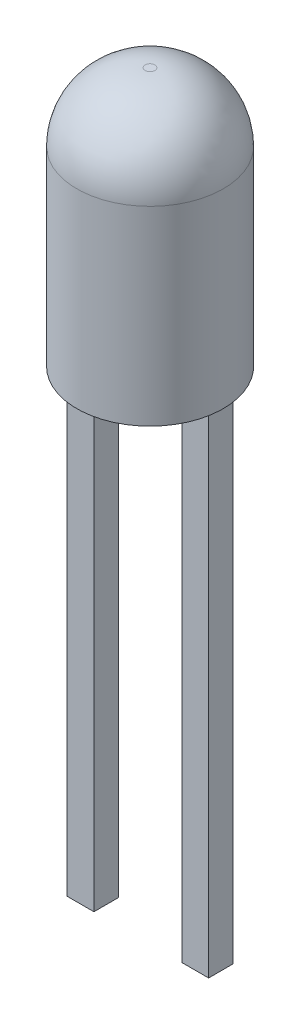
ISO-10303-21;
HEADER;
FILE_DESCRIPTION(('STEP AP214'),'2;1');
FILE_NAME('part.step','',(''),(''),'','','');
FILE_SCHEMA(('AUTOMOTIVE_DESIGN { 1 0 10303 214 1 1 1 1 }'));
ENDSEC;
DATA;
#1=APPLICATION_CONTEXT('core data for automotive mechanical design processes');
#2=APPLICATION_PROTOCOL_DEFINITION('international standard','automotive_design',2000,#1);
#3=PRODUCT_CONTEXT('',#1,'mechanical');
#4=PRODUCT('Part','Part','',(#3));
#5=PRODUCT_RELATED_PRODUCT_CATEGORY('part','',(#4));
#6=PRODUCT_DEFINITION_FORMATION('','',#4);
#7=PRODUCT_DEFINITION_CONTEXT('part definition',#1,'design');
#8=PRODUCT_DEFINITION('design','',#6,#7);
#9=PRODUCT_DEFINITION_SHAPE('','',#8);
#10=(LENGTH_UNIT() NAMED_UNIT(*) SI_UNIT(.MILLI.,.METRE.));
#11=(NAMED_UNIT(*) PLANE_ANGLE_UNIT() SI_UNIT($,.RADIAN.));
#12=(NAMED_UNIT(*) SI_UNIT($,.STERADIAN.) SOLID_ANGLE_UNIT());
#13=UNCERTAINTY_MEASURE_WITH_UNIT(LENGTH_MEASURE(1.E-05),#10,'distance_accuracy_value','');
#14=(GEOMETRIC_REPRESENTATION_CONTEXT(3) GLOBAL_UNCERTAINTY_ASSIGNED_CONTEXT((#13)) GLOBAL_UNIT_ASSIGNED_CONTEXT((#10,
#11,#12)) REPRESENTATION_CONTEXT('',''));
#15=CARTESIAN_POINT('',(0.,0.,0.));
#16=DIRECTION('',(0.,0.,1.));
#17=DIRECTION('',(1.,0.,0.));
#18=AXIS2_PLACEMENT_3D('',#15,#16,#17);
#19=CARTESIAN_POINT('',(0.,0.,-0.25));
#20=DIRECTION('',(0.,0.,1.));
#21=DIRECTION('',(1.,0.,0.));
#22=AXIS2_PLACEMENT_3D('',#19,#20,#21);
#23=PLANE('',#22);
#24=DIRECTION('',(1.,0.,0.));
#25=VECTOR('',#24,1.);
#26=CARTESIAN_POINT('',(0.,0.,-0.25));
#27=LINE('',#26,#25);
#28=CARTESIAN_POINT('',(0.899999999999999,0.,-0.25));
#29=VERTEX_POINT('',#28);
#30=CARTESIAN_POINT('',(1.45,0.,-0.25));
#31=VERTEX_POINT('',#30);
#32=EDGE_CURVE('P0_E83',#29,#31,#27,.T.);
#33=ORIENTED_EDGE('',*,*,#32,.F.);
#34=DIRECTION('',(0.,1.,0.));
#35=VECTOR('',#34,1.);
#36=CARTESIAN_POINT('',(0.899999999999999,0.,-0.25));
#37=LINE('',#36,#35);
#38=CARTESIAN_POINT('',(0.899999999999999,0.6,-0.25));
#39=VERTEX_POINT('',#38);
#40=EDGE_CURVE('P0_E65',#39,#29,#37,.F.);
#41=ORIENTED_EDGE('',*,*,#40,.F.);
#42=DIRECTION('',(1.,0.,0.));
#43=VECTOR('',#42,1.);
#44=CARTESIAN_POINT('',(0.,0.6,-0.25));
#45=LINE('',#44,#43);
#46=CARTESIAN_POINT('',(0.496677265615149,0.6,-0.25));
#47=VERTEX_POINT('',#46);
#48=EDGE_CURVE('P0_E19',#47,#39,#45,.T.);
#49=ORIENTED_EDGE('',*,*,#48,.F.);
#50=DIRECTION('',(0.56488315762426,-0.825170902439274,0.));
#51=VECTOR('',#50,1.);
#52=CARTESIAN_POINT('',(-0.872452828416084,2.6,-0.25));
#53=LINE('',#52,#51);
#54=CARTESIAN_POINT('',(-0.872452828416084,2.6,-0.25));
#55=VERTEX_POINT('',#54);
#56=EDGE_CURVE('P0_E96',#55,#47,#53,.T.);
#57=ORIENTED_EDGE('',*,*,#56,.F.);
#58=DIRECTION('',(-1.,0.,0.));
#59=VECTOR('',#58,1.);
#60=CARTESIAN_POINT('',(1.45,2.6,-0.25));
#61=LINE('',#60,#59);
#62=CARTESIAN_POINT('',(1.45,2.6,-0.25));
#63=VERTEX_POINT('',#62);
#64=EDGE_CURVE('P0_E91',#63,#55,#61,.T.);
#65=ORIENTED_EDGE('',*,*,#64,.F.);
#66=DIRECTION('',(0.,1.,0.));
#67=VECTOR('',#66,1.);
#68=CARTESIAN_POINT('',(1.45,0.,-0.25));
#69=LINE('',#68,#67);
#70=EDGE_CURVE('P0_E84',#31,#63,#69,.T.);
#71=ORIENTED_EDGE('',*,*,#70,.F.);
#72=EDGE_LOOP('',(#33,#41,#49,#57,#65,#71));
#73=FACE_BOUND('',#72,.T.);
#74=ADVANCED_FACE('P0_F16',(#73),#23,.F.);
#75=CARTESIAN_POINT('',(1.45,0.,-0.25));
#76=DIRECTION('',(1.,0.,0.));
#77=DIRECTION('',(0.,1.,0.));
#78=AXIS2_PLACEMENT_3D('',#75,#76,#77);
#79=PLANE('',#78);
#80=DIRECTION('',(0.,0.,1.));
#81=VECTOR('',#80,1.);
#82=CARTESIAN_POINT('',(1.45,0.,-0.25));
#83=LINE('',#82,#81);
#84=CARTESIAN_POINT('',(1.45,0.,0.25));
#85=VERTEX_POINT('',#84);
#86=EDGE_CURVE('P0_E79',#31,#85,#83,.T.);
#87=ORIENTED_EDGE('',*,*,#86,.F.);
#88=ORIENTED_EDGE('',*,*,#70,.T.);
#89=DIRECTION('',(0.,0.,1.));
#90=VECTOR('',#89,1.);
#91=CARTESIAN_POINT('',(1.45,2.6,-0.25));
#92=LINE('',#91,#90);
#93=CARTESIAN_POINT('',(1.45,2.6,0.25));
#94=VERTEX_POINT('',#93);
#95=EDGE_CURVE('P0_E88',#94,#63,#92,.F.);
#96=ORIENTED_EDGE('',*,*,#95,.F.);
#97=DIRECTION('',(0.,1.,0.));
#98=VECTOR('',#97,1.);
#99=CARTESIAN_POINT('',(1.45,0.,0.25));
#100=LINE('',#99,#98);
#101=EDGE_CURVE('P0_E102',#85,#94,#100,.T.);
#102=ORIENTED_EDGE('',*,*,#101,.F.);
#103=EDGE_LOOP('',(#87,#88,#96,#102));
#104=FACE_BOUND('',#103,.T.);
#105=ADVANCED_FACE('P0_F124',(#104),#79,.T.);
#106=CARTESIAN_POINT('',(1.45,2.6,-0.25));
#107=DIRECTION('',(0.,1.,0.));
#108=DIRECTION('',(-1.,0.,0.));
#109=AXIS2_PLACEMENT_3D('',#106,#107,#108);
#110=PLANE('',#109);
#111=ORIENTED_EDGE('',*,*,#95,.T.);
#112=ORIENTED_EDGE('',*,*,#64,.T.);
#113=DIRECTION('',(0.,0.,1.));
#114=VECTOR('',#113,1.);
#115=CARTESIAN_POINT('',(-0.872452828416084,2.6,-0.25));
#116=LINE('',#115,#114);
#117=CARTESIAN_POINT('',(-0.872452828416084,2.6,0.25));
#118=VERTEX_POINT('',#117);
#119=EDGE_CURVE('P0_E93',#118,#55,#116,.F.);
#120=ORIENTED_EDGE('',*,*,#119,.F.);
#121=DIRECTION('',(1.,0.,0.));
#122=VECTOR('',#121,1.);
#123=CARTESIAN_POINT('',(0.,2.6,0.25));
#124=LINE('',#123,#122);
#125=EDGE_CURVE('P0_E105',#94,#118,#124,.F.);
#126=ORIENTED_EDGE('',*,*,#125,.F.);
#127=EDGE_LOOP('',(#111,#112,#120,#126));
#128=FACE_BOUND('',#127,.T.);
#129=ADVANCED_FACE('P0_F122',(#128),#110,.T.);
#130=CARTESIAN_POINT('',(-0.872452828416084,2.6,-0.25));
#131=DIRECTION('',(-0.825170902439274,-0.56488315762426,0.));
#132=DIRECTION('',(0.56488315762426,-0.825170902439274,0.));
#133=AXIS2_PLACEMENT_3D('',#130,#131,#132);
#134=PLANE('',#133);
#135=ORIENTED_EDGE('',*,*,#119,.T.);
#136=ORIENTED_EDGE('',*,*,#56,.T.);
#137=DIRECTION('',(0.,0.,-1.));
#138=VECTOR('',#137,1.);
#139=CARTESIAN_POINT('',(0.496677265615149,0.6,-0.25));
#140=LINE('',#139,#138);
#141=CARTESIAN_POINT('',(0.496677265615149,0.6,0.25));
#142=VERTEX_POINT('',#141);
#143=EDGE_CURVE('P0_E72',#142,#47,#140,.T.);
#144=ORIENTED_EDGE('',*,*,#143,.F.);
#145=DIRECTION('',(0.56488315762426,-0.825170902439274,0.));
#146=VECTOR('',#145,1.);
#147=CARTESIAN_POINT('',(-0.872452828416084,2.6,0.25));
#148=LINE('',#147,#146);
#149=EDGE_CURVE('P0_E108',#118,#142,#148,.T.);
#150=ORIENTED_EDGE('',*,*,#149,.F.);
#151=EDGE_LOOP('',(#135,#136,#144,#150));
#152=FACE_BOUND('',#151,.T.);
#153=ADVANCED_FACE('P0_F118',(#152),#134,.T.);
#154=CARTESIAN_POINT('',(0.496677265615149,0.6,-0.25));
#155=DIRECTION('',(0.,-1.,0.));
#156=DIRECTION('',(0.,0.,-1.));
#157=AXIS2_PLACEMENT_3D('',#154,#155,#156);
#158=PLANE('',#157);
#159=ORIENTED_EDGE('',*,*,#143,.T.);
#160=ORIENTED_EDGE('',*,*,#48,.T.);
#161=DIRECTION('',(0.,0.,1.));
#162=VECTOR('',#161,1.);
#163=CARTESIAN_POINT('',(0.899999999999999,0.6,-0.25));
#164=LINE('',#163,#162);
#165=CARTESIAN_POINT('',(0.899999999999999,0.6,0.25));
#166=VERTEX_POINT('',#165);
#167=EDGE_CURVE('P0_E71',#166,#39,#164,.F.);
#168=ORIENTED_EDGE('',*,*,#167,.F.);
#169=DIRECTION('',(1.,0.,0.));
#170=VECTOR('',#169,1.);
#171=CARTESIAN_POINT('',(0.,0.6,0.25));
#172=LINE('',#171,#170);
#173=EDGE_CURVE('P0_E111',#142,#166,#172,.T.);
#174=ORIENTED_EDGE('',*,*,#173,.F.);
#175=EDGE_LOOP('',(#159,#160,#168,#174));
#176=FACE_BOUND('',#175,.T.);
#177=ADVANCED_FACE('P0_F69',(#176),#158,.T.);
#178=CARTESIAN_POINT('',(0.899999999999999,0.6,-0.25));
#179=DIRECTION('',(-1.,0.,0.));
#180=DIRECTION('',(0.,0.,1.));
#181=AXIS2_PLACEMENT_3D('',#178,#179,#180);
#182=PLANE('',#181);
#183=ORIENTED_EDGE('',*,*,#167,.T.);
#184=ORIENTED_EDGE('',*,*,#40,.T.);
#185=DIRECTION('',(0.,0.,1.));
#186=VECTOR('',#185,1.);
#187=CARTESIAN_POINT('',(0.899999999999999,0.,-0.25));
#188=LINE('',#187,#186);
#189=CARTESIAN_POINT('',(0.899999999999999,0.,0.25));
#190=VERTEX_POINT('',#189);
#191=EDGE_CURVE('P0_E34',#190,#29,#188,.F.);
#192=ORIENTED_EDGE('',*,*,#191,.F.);
#193=DIRECTION('',(0.,1.,0.));
#194=VECTOR('',#193,1.);
#195=CARTESIAN_POINT('',(0.899999999999999,0.,0.25));
#196=LINE('',#195,#194);
#197=EDGE_CURVE('P0_E25',#166,#190,#196,.F.);
#198=ORIENTED_EDGE('',*,*,#197,.F.);
#199=EDGE_LOOP('',(#183,#184,#192,#198));
#200=FACE_BOUND('',#199,.T.);
#201=ADVANCED_FACE('P0_F76',(#200),#182,.T.);
#202=CARTESIAN_POINT('',(0.899999999999999,0.,-0.25));
#203=DIRECTION('',(0.,-1.,0.));
#204=DIRECTION('',(1.,0.,0.));
#205=AXIS2_PLACEMENT_3D('',#202,#203,#204);
#206=PLANE('',#205);
#207=ORIENTED_EDGE('',*,*,#191,.T.);
#208=ORIENTED_EDGE('',*,*,#32,.T.);
#209=ORIENTED_EDGE('',*,*,#86,.T.);
#210=DIRECTION('',(1.,0.,0.));
#211=VECTOR('',#210,1.);
#212=CARTESIAN_POINT('',(0.,0.,0.25));
#213=LINE('',#212,#211);
#214=EDGE_CURVE('P0_E11',#190,#85,#213,.T.);
#215=ORIENTED_EDGE('',*,*,#214,.F.);
#216=EDGE_LOOP('',(#207,#208,#209,#215));
#217=FACE_BOUND('',#216,.T.);
#218=ADVANCED_FACE('P0_F126',(#217),#206,.T.);
#219=CARTESIAN_POINT('',(0.,0.,0.25));
#220=DIRECTION('',(0.,0.,1.));
#221=DIRECTION('',(1.,0.,0.));
#222=AXIS2_PLACEMENT_3D('',#219,#220,#221);
#223=PLANE('',#222);
#224=ORIENTED_EDGE('',*,*,#197,.T.);
#225=ORIENTED_EDGE('',*,*,#214,.T.);
#226=ORIENTED_EDGE('',*,*,#101,.T.);
#227=ORIENTED_EDGE('',*,*,#125,.T.);
#228=ORIENTED_EDGE('',*,*,#149,.T.);
#229=ORIENTED_EDGE('',*,*,#173,.T.);
#230=EDGE_LOOP('',(#224,#225,#226,#227,#228,#229));
#231=FACE_BOUND('',#230,.T.);
#232=ADVANCED_FACE('P0_F114',(#231),#223,.T.);
#233=CLOSED_SHELL('',(#74,#105,#129,#153,#177,#201,#218,#232));
#234=MANIFOLD_SOLID_BREP('P0_B1',#233);
#235=CARTESIAN_POINT('',(0.899999999999999,-10.,0.25));
#236=DIRECTION('',(0.,0.,-1.));
#237=DIRECTION('',(-1.,0.,0.));
#238=AXIS2_PLACEMENT_3D('',#235,#236,#237);
#239=PLANE('',#238);
#240=DIRECTION('',(0.,1.,0.));
#241=VECTOR('',#240,1.);
#242=CARTESIAN_POINT('',(0.899999999999999,-10.,0.25));
#243=LINE('',#242,#241);
#244=CARTESIAN_POINT('',(0.899999999999999,0.,0.25));
#245=VERTEX_POINT('',#244);
#246=CARTESIAN_POINT('',(0.899999999999999,-10.,0.25));
#247=VERTEX_POINT('',#246);
#248=EDGE_CURVE('P1_E57',#245,#247,#243,.F.);
#249=ORIENTED_EDGE('',*,*,#248,.T.);
#250=DIRECTION('',(1.,0.,0.));
#251=VECTOR('',#250,1.);
#252=CARTESIAN_POINT('',(0.,-10.,0.25));
#253=LINE('',#252,#251);
#254=CARTESIAN_POINT('',(1.45,-10.,0.25));
#255=VERTEX_POINT('',#254);
#256=EDGE_CURVE('P1_E54',#255,#247,#253,.F.);
#257=ORIENTED_EDGE('',*,*,#256,.F.);
#258=DIRECTION('',(0.,1.,0.));
#259=VECTOR('',#258,1.);
#260=CARTESIAN_POINT('',(1.45,-10.,0.25));
#261=LINE('',#260,#259);
#262=CARTESIAN_POINT('',(1.45,0.,0.25));
#263=VERTEX_POINT('',#262);
#264=EDGE_CURVE('P1_E76',#255,#263,#261,.T.);
#265=ORIENTED_EDGE('',*,*,#264,.T.);
#266=DIRECTION('',(-1.,0.,0.));
#267=VECTOR('',#266,1.);
#268=CARTESIAN_POINT('',(0.899999999999999,0.,0.25));
#269=LINE('',#268,#267);
#270=EDGE_CURVE('P1_E19',#245,#263,#269,.F.);
#271=ORIENTED_EDGE('',*,*,#270,.F.);
#272=EDGE_LOOP('',(#249,#257,#265,#271));
#273=FACE_BOUND('',#272,.T.);
#274=ADVANCED_FACE('P1_F16',(#273),#239,.F.);
#275=CARTESIAN_POINT('',(0.899999999999999,-10.,0.25));
#276=DIRECTION('',(1.,0.,0.));
#277=DIRECTION('',(0.,0.,-1.));
#278=AXIS2_PLACEMENT_3D('',#275,#276,#277);
#279=PLANE('',#278);
#280=DIRECTION('',(0.,1.,0.));
#281=VECTOR('',#280,1.);
#282=CARTESIAN_POINT('',(0.899999999999999,-10.,-0.25));
#283=LINE('',#282,#281);
#284=CARTESIAN_POINT('',(0.899999999999999,0.,-0.25));
#285=VERTEX_POINT('',#284);
#286=CARTESIAN_POINT('',(0.899999999999999,-10.,-0.25));
#287=VERTEX_POINT('',#286);
#288=EDGE_CURVE('P1_E72',#285,#287,#283,.F.);
#289=ORIENTED_EDGE('',*,*,#288,.T.);
#290=DIRECTION('',(0.,0.,-1.));
#291=VECTOR('',#290,1.);
#292=CARTESIAN_POINT('',(0.899999999999999,-10.,0.));
#293=LINE('',#292,#291);
#294=EDGE_CURVE('P1_E62',#247,#287,#293,.T.);
#295=ORIENTED_EDGE('',*,*,#294,.F.);
#296=ORIENTED_EDGE('',*,*,#248,.F.);
#297=DIRECTION('',(0.,0.,-1.));
#298=VECTOR('',#297,1.);
#299=CARTESIAN_POINT('',(0.899999999999999,0.,0.));
#300=LINE('',#299,#298);
#301=EDGE_CURVE('P1_E79',#245,#285,#300,.T.);
#302=ORIENTED_EDGE('',*,*,#301,.T.);
#303=EDGE_LOOP('',(#289,#295,#296,#302));
#304=FACE_BOUND('',#303,.T.);
#305=ADVANCED_FACE('P1_F71',(#304),#279,.F.);
#306=CARTESIAN_POINT('',(0.,-10.,0.));
#307=DIRECTION('',(0.,-1.,0.));
#308=DIRECTION('',(0.,0.,-1.));
#309=AXIS2_PLACEMENT_3D('',#306,#307,#308);
#310=PLANE('',#309);
#311=DIRECTION('',(0.,0.,1.));
#312=VECTOR('',#311,1.);
#313=CARTESIAN_POINT('',(1.45,-10.,0.25));
#314=LINE('',#313,#312);
#315=CARTESIAN_POINT('',(1.45,-10.,-0.25));
#316=VERTEX_POINT('',#315);
#317=EDGE_CURVE('P1_E68',#316,#255,#314,.T.);
#318=ORIENTED_EDGE('',*,*,#317,.T.);
#319=ORIENTED_EDGE('',*,*,#256,.T.);
#320=ORIENTED_EDGE('',*,*,#294,.T.);
#321=DIRECTION('',(1.,0.,0.));
#322=VECTOR('',#321,1.);
#323=CARTESIAN_POINT('',(0.899999999999999,-10.,-0.25));
#324=LINE('',#323,#322);
#325=EDGE_CURVE('P1_E82',#287,#316,#324,.T.);
#326=ORIENTED_EDGE('',*,*,#325,.T.);
#327=EDGE_LOOP('',(#318,#319,#320,#326));
#328=FACE_BOUND('',#327,.T.);
#329=ADVANCED_FACE('P1_F65',(#328),#310,.T.);
#330=CARTESIAN_POINT('',(1.45,-10.,0.25));
#331=DIRECTION('',(-1.,0.,0.));
#332=DIRECTION('',(0.,0.,1.));
#333=AXIS2_PLACEMENT_3D('',#330,#331,#332);
#334=PLANE('',#333);
#335=ORIENTED_EDGE('',*,*,#264,.F.);
#336=ORIENTED_EDGE('',*,*,#317,.F.);
#337=DIRECTION('',(0.,1.,0.));
#338=VECTOR('',#337,1.);
#339=CARTESIAN_POINT('',(1.45,-10.,-0.25));
#340=LINE('',#339,#338);
#341=CARTESIAN_POINT('',(1.45,0.,-0.25));
#342=VERTEX_POINT('',#341);
#343=EDGE_CURVE('P1_E25',#316,#342,#340,.T.);
#344=ORIENTED_EDGE('',*,*,#343,.T.);
#345=DIRECTION('',(0.,0.,-1.));
#346=VECTOR('',#345,1.);
#347=CARTESIAN_POINT('',(1.45,0.,0.));
#348=LINE('',#347,#346);
#349=EDGE_CURVE('P1_E33',#342,#263,#348,.F.);
#350=ORIENTED_EDGE('',*,*,#349,.T.);
#351=EDGE_LOOP('',(#335,#336,#344,#350));
#352=FACE_BOUND('',#351,.T.);
#353=ADVANCED_FACE('P1_F87',(#352),#334,.F.);
#354=CARTESIAN_POINT('',(0.,0.,0.));
#355=DIRECTION('',(0.,-1.,0.));
#356=DIRECTION('',(0.,0.,-1.));
#357=AXIS2_PLACEMENT_3D('',#354,#355,#356);
#358=PLANE('',#357);
#359=ORIENTED_EDGE('',*,*,#270,.T.);
#360=ORIENTED_EDGE('',*,*,#349,.F.);
#361=DIRECTION('',(1.,0.,0.));
#362=VECTOR('',#361,1.);
#363=CARTESIAN_POINT('',(0.899999999999999,0.,-0.25));
#364=LINE('',#363,#362);
#365=EDGE_CURVE('P1_E11',#342,#285,#364,.F.);
#366=ORIENTED_EDGE('',*,*,#365,.T.);
#367=ORIENTED_EDGE('',*,*,#301,.F.);
#368=EDGE_LOOP('',(#359,#360,#366,#367));
#369=FACE_BOUND('',#368,.T.);
#370=ADVANCED_FACE('P1_F90',(#369),#358,.F.);
#371=CARTESIAN_POINT('',(0.899999999999999,-10.,-0.25));
#372=DIRECTION('',(0.,0.,1.));
#373=DIRECTION('',(1.,0.,0.));
#374=AXIS2_PLACEMENT_3D('',#371,#372,#373);
#375=PLANE('',#374);
#376=ORIENTED_EDGE('',*,*,#343,.F.);
#377=ORIENTED_EDGE('',*,*,#325,.F.);
#378=ORIENTED_EDGE('',*,*,#288,.F.);
#379=ORIENTED_EDGE('',*,*,#365,.F.);
#380=EDGE_LOOP('',(#376,#377,#378,#379));
#381=FACE_BOUND('',#380,.T.);
#382=ADVANCED_FACE('P1_F89',(#381),#375,.F.);
#383=CLOSED_SHELL('',(#274,#305,#329,#353,#370,#382));
#384=MANIFOLD_SOLID_BREP('P1_B1',#383);
#385=CARTESIAN_POINT('',(-1.45,-10.,0.25));
#386=DIRECTION('',(0.,0.,-1.));
#387=DIRECTION('',(-1.,0.,0.));
#388=AXIS2_PLACEMENT_3D('',#385,#386,#387);
#389=PLANE('',#388);
#390=DIRECTION('',(0.,1.,0.));
#391=VECTOR('',#390,1.);
#392=CARTESIAN_POINT('',(-1.45,-10.,0.25));
#393=LINE('',#392,#391);
#394=CARTESIAN_POINT('',(-1.45,0.,0.25));
#395=VERTEX_POINT('',#394);
#396=CARTESIAN_POINT('',(-1.45,-10.,0.25));
#397=VERTEX_POINT('',#396);
#398=EDGE_CURVE('P2_E57',#395,#397,#393,.F.);
#399=ORIENTED_EDGE('',*,*,#398,.T.);
#400=DIRECTION('',(1.,0.,0.));
#401=VECTOR('',#400,1.);
#402=CARTESIAN_POINT('',(0.,-10.,0.25));
#403=LINE('',#402,#401);
#404=CARTESIAN_POINT('',(-0.9,-10.,0.25));
#405=VERTEX_POINT('',#404);
#406=EDGE_CURVE('P2_E54',#405,#397,#403,.F.);
#407=ORIENTED_EDGE('',*,*,#406,.F.);
#408=DIRECTION('',(0.,1.,0.));
#409=VECTOR('',#408,1.);
#410=CARTESIAN_POINT('',(-0.9,-10.,0.25));
#411=LINE('',#410,#409);
#412=CARTESIAN_POINT('',(-0.9,0.,0.25));
#413=VERTEX_POINT('',#412);
#414=EDGE_CURVE('P2_E76',#405,#413,#411,.T.);
#415=ORIENTED_EDGE('',*,*,#414,.T.);
#416=DIRECTION('',(-1.,0.,0.));
#417=VECTOR('',#416,1.);
#418=CARTESIAN_POINT('',(-1.45,0.,0.25));
#419=LINE('',#418,#417);
#420=EDGE_CURVE('P2_E19',#395,#413,#419,.F.);
#421=ORIENTED_EDGE('',*,*,#420,.F.);
#422=EDGE_LOOP('',(#399,#407,#415,#421));
#423=FACE_BOUND('',#422,.T.);
#424=ADVANCED_FACE('P2_F16',(#423),#389,.F.);
#425=CARTESIAN_POINT('',(-1.45,-10.,0.25));
#426=DIRECTION('',(1.,0.,0.));
#427=DIRECTION('',(0.,0.,-1.));
#428=AXIS2_PLACEMENT_3D('',#425,#426,#427);
#429=PLANE('',#428);
#430=DIRECTION('',(0.,1.,0.));
#431=VECTOR('',#430,1.);
#432=CARTESIAN_POINT('',(-1.45,-10.,-0.25));
#433=LINE('',#432,#431);
#434=CARTESIAN_POINT('',(-1.45,0.,-0.25));
#435=VERTEX_POINT('',#434);
#436=CARTESIAN_POINT('',(-1.45,-10.,-0.25));
#437=VERTEX_POINT('',#436);
#438=EDGE_CURVE('P2_E72',#435,#437,#433,.F.);
#439=ORIENTED_EDGE('',*,*,#438,.T.);
#440=DIRECTION('',(0.,0.,-1.));
#441=VECTOR('',#440,1.);
#442=CARTESIAN_POINT('',(-1.45,-10.,0.));
#443=LINE('',#442,#441);
#444=EDGE_CURVE('P2_E62',#397,#437,#443,.T.);
#445=ORIENTED_EDGE('',*,*,#444,.F.);
#446=ORIENTED_EDGE('',*,*,#398,.F.);
#447=DIRECTION('',(0.,0.,-1.));
#448=VECTOR('',#447,1.);
#449=CARTESIAN_POINT('',(-1.45,0.,0.));
#450=LINE('',#449,#448);
#451=EDGE_CURVE('P2_E79',#395,#435,#450,.T.);
#452=ORIENTED_EDGE('',*,*,#451,.T.);
#453=EDGE_LOOP('',(#439,#445,#446,#452));
#454=FACE_BOUND('',#453,.T.);
#455=ADVANCED_FACE('P2_F71',(#454),#429,.F.);
#456=CARTESIAN_POINT('',(0.,-10.,0.));
#457=DIRECTION('',(0.,-1.,0.));
#458=DIRECTION('',(0.,0.,-1.));
#459=AXIS2_PLACEMENT_3D('',#456,#457,#458);
#460=PLANE('',#459);
#461=DIRECTION('',(0.,0.,1.));
#462=VECTOR('',#461,1.);
#463=CARTESIAN_POINT('',(-0.9,-10.,0.25));
#464=LINE('',#463,#462);
#465=CARTESIAN_POINT('',(-0.9,-10.,-0.25));
#466=VERTEX_POINT('',#465);
#467=EDGE_CURVE('P2_E68',#466,#405,#464,.T.);
#468=ORIENTED_EDGE('',*,*,#467,.T.);
#469=ORIENTED_EDGE('',*,*,#406,.T.);
#470=ORIENTED_EDGE('',*,*,#444,.T.);
#471=DIRECTION('',(1.,0.,0.));
#472=VECTOR('',#471,1.);
#473=CARTESIAN_POINT('',(-1.45,-10.,-0.25));
#474=LINE('',#473,#472);
#475=EDGE_CURVE('P2_E82',#437,#466,#474,.T.);
#476=ORIENTED_EDGE('',*,*,#475,.T.);
#477=EDGE_LOOP('',(#468,#469,#470,#476));
#478=FACE_BOUND('',#477,.T.);
#479=ADVANCED_FACE('P2_F65',(#478),#460,.T.);
#480=CARTESIAN_POINT('',(-0.9,-10.,0.25));
#481=DIRECTION('',(-1.,0.,0.));
#482=DIRECTION('',(0.,0.,1.));
#483=AXIS2_PLACEMENT_3D('',#480,#481,#482);
#484=PLANE('',#483);
#485=ORIENTED_EDGE('',*,*,#414,.F.);
#486=ORIENTED_EDGE('',*,*,#467,.F.);
#487=DIRECTION('',(0.,1.,0.));
#488=VECTOR('',#487,1.);
#489=CARTESIAN_POINT('',(-0.9,-10.,-0.25));
#490=LINE('',#489,#488);
#491=CARTESIAN_POINT('',(-0.9,0.,-0.25));
#492=VERTEX_POINT('',#491);
#493=EDGE_CURVE('P2_E25',#466,#492,#490,.T.);
#494=ORIENTED_EDGE('',*,*,#493,.T.);
#495=DIRECTION('',(0.,0.,-1.));
#496=VECTOR('',#495,1.);
#497=CARTESIAN_POINT('',(-0.9,0.,0.));
#498=LINE('',#497,#496);
#499=EDGE_CURVE('P2_E33',#492,#413,#498,.F.);
#500=ORIENTED_EDGE('',*,*,#499,.T.);
#501=EDGE_LOOP('',(#485,#486,#494,#500));
#502=FACE_BOUND('',#501,.T.);
#503=ADVANCED_FACE('P2_F87',(#502),#484,.F.);
#504=CARTESIAN_POINT('',(0.,0.,0.));
#505=DIRECTION('',(0.,-1.,0.));
#506=DIRECTION('',(0.,0.,-1.));
#507=AXIS2_PLACEMENT_3D('',#504,#505,#506);
#508=PLANE('',#507);
#509=ORIENTED_EDGE('',*,*,#420,.T.);
#510=ORIENTED_EDGE('',*,*,#499,.F.);
#511=DIRECTION('',(1.,0.,0.));
#512=VECTOR('',#511,1.);
#513=CARTESIAN_POINT('',(-1.45,0.,-0.25));
#514=LINE('',#513,#512);
#515=EDGE_CURVE('P2_E11',#492,#435,#514,.F.);
#516=ORIENTED_EDGE('',*,*,#515,.T.);
#517=ORIENTED_EDGE('',*,*,#451,.F.);
#518=EDGE_LOOP('',(#509,#510,#516,#517));
#519=FACE_BOUND('',#518,.T.);
#520=ADVANCED_FACE('P2_F90',(#519),#508,.F.);
#521=CARTESIAN_POINT('',(-1.45,-10.,-0.25));
#522=DIRECTION('',(0.,0.,1.));
#523=DIRECTION('',(1.,0.,0.));
#524=AXIS2_PLACEMENT_3D('',#521,#522,#523);
#525=PLANE('',#524);
#526=ORIENTED_EDGE('',*,*,#493,.F.);
#527=ORIENTED_EDGE('',*,*,#475,.F.);
#528=ORIENTED_EDGE('',*,*,#438,.F.);
#529=ORIENTED_EDGE('',*,*,#515,.F.);
#530=EDGE_LOOP('',(#526,#527,#528,#529));
#531=FACE_BOUND('',#530,.T.);
#532=ADVANCED_FACE('P2_F89',(#531),#525,.F.);
#533=CLOSED_SHELL('',(#424,#455,#479,#503,#520,#532));
#534=MANIFOLD_SOLID_BREP('P2_B1',#533);
#535=CARTESIAN_POINT('',(0.,0.,0.25));
#536=DIRECTION('',(0.,0.,-1.));
#537=DIRECTION('',(-1.,0.,0.));
#538=AXIS2_PLACEMENT_3D('',#535,#536,#537);
#539=PLANE('',#538);
#540=DIRECTION('',(-1.,0.,0.));
#541=VECTOR('',#540,1.);
#542=CARTESIAN_POINT('',(0.,0.6,0.25));
#543=LINE('',#542,#541);
#544=CARTESIAN_POINT('',(-0.62411419560851,0.6,0.25));
#545=VERTEX_POINT('',#544);
#546=CARTESIAN_POINT('',(-0.9,0.6,0.25));
#547=VERTEX_POINT('',#546);
#548=EDGE_CURVE('P3_E82',#545,#547,#543,.T.);
#549=ORIENTED_EDGE('',*,*,#548,.F.);
#550=DIRECTION('',(0.,1.,0.));
#551=VECTOR('',#550,1.);
#552=CARTESIAN_POINT('',(-0.62411419560851,0.,0.25));
#553=LINE('',#552,#551);
#554=CARTESIAN_POINT('',(-0.62411419560851,0.825037810223286,0.25));
#555=VERTEX_POINT('',#554);
#556=EDGE_CURVE('P3_E19',#555,#545,#553,.F.);
#557=ORIENTED_EDGE('',*,*,#556,.F.);
#558=DIRECTION('',(-0.320828110303952,0.947137436510032,0.));
#559=VECTOR('',#558,1.);
#560=CARTESIAN_POINT('',(-0.62411419560851,0.825037810223286,0.25));
#561=LINE('',#560,#559);
#562=CARTESIAN_POINT('',(-1.22535509609001,2.6,0.25));
#563=VERTEX_POINT('',#562);
#564=EDGE_CURVE('P3_E109',#563,#555,#561,.F.);
#565=ORIENTED_EDGE('',*,*,#564,.F.);
#566=DIRECTION('',(1.,0.,0.));
#567=VECTOR('',#566,1.);
#568=CARTESIAN_POINT('',(-1.22535509609001,2.6,0.25));
#569=LINE('',#568,#567);
#570=CARTESIAN_POINT('',(-1.45,2.6,0.25));
#571=VERTEX_POINT('',#570);
#572=EDGE_CURVE('P3_E104',#571,#563,#569,.T.);
#573=ORIENTED_EDGE('',*,*,#572,.F.);
#574=DIRECTION('',(0.,1.,0.));
#575=VECTOR('',#574,1.);
#576=CARTESIAN_POINT('',(-1.45,2.6,0.25));
#577=LINE('',#576,#575);
#578=CARTESIAN_POINT('',(-1.45,0.,0.25));
#579=VERTEX_POINT('',#578);
#580=EDGE_CURVE('P3_E99',#579,#571,#577,.T.);
#581=ORIENTED_EDGE('',*,*,#580,.F.);
#582=DIRECTION('',(1.,0.,0.));
#583=VECTOR('',#582,1.);
#584=CARTESIAN_POINT('',(-1.45,0.,0.25));
#585=LINE('',#584,#583);
#586=CARTESIAN_POINT('',(-0.9,0.,0.25));
#587=VERTEX_POINT('',#586);
#588=EDGE_CURVE('P3_E94',#587,#579,#585,.F.);
#589=ORIENTED_EDGE('',*,*,#588,.F.);
#590=DIRECTION('',(0.,1.,0.));
#591=VECTOR('',#590,1.);
#592=CARTESIAN_POINT('',(-0.9,0.,0.25));
#593=LINE('',#592,#591);
#594=EDGE_CURVE('P3_E73',#547,#587,#593,.F.);
#595=ORIENTED_EDGE('',*,*,#594,.F.);
#596=EDGE_LOOP('',(#549,#557,#565,#573,#581,#589,#595));
#597=FACE_BOUND('',#596,.T.);
#598=ADVANCED_FACE('P3_F16',(#597),#539,.F.);
#599=CARTESIAN_POINT('',(-0.9,0.,-0.25));
#600=DIRECTION('',(1.,0.,0.));
#601=DIRECTION('',(0.,0.,-1.));
#602=AXIS2_PLACEMENT_3D('',#599,#600,#601);
#603=PLANE('',#602);
#604=DIRECTION('',(0.,0.,1.));
#605=VECTOR('',#604,1.);
#606=CARTESIAN_POINT('',(-0.9,0.,-0.25));
#607=LINE('',#606,#605);
#608=CARTESIAN_POINT('',(-0.9,0.,-0.25));
#609=VERTEX_POINT('',#608);
#610=EDGE_CURVE('P3_E89',#609,#587,#607,.T.);
#611=ORIENTED_EDGE('',*,*,#610,.F.);
#612=DIRECTION('',(0.,1.,0.));
#613=VECTOR('',#612,1.);
#614=CARTESIAN_POINT('',(-0.9,0.,-0.25));
#615=LINE('',#614,#613);
#616=CARTESIAN_POINT('',(-0.9,0.6,-0.25));
#617=VERTEX_POINT('',#616);
#618=EDGE_CURVE('P3_E113',#617,#609,#615,.F.);
#619=ORIENTED_EDGE('',*,*,#618,.F.);
#620=DIRECTION('',(0.,0.,-1.));
#621=VECTOR('',#620,1.);
#622=CARTESIAN_POINT('',(-0.9,0.6,-0.25));
#623=LINE('',#622,#621);
#624=EDGE_CURVE('P3_E87',#547,#617,#623,.T.);
#625=ORIENTED_EDGE('',*,*,#624,.F.);
#626=ORIENTED_EDGE('',*,*,#594,.T.);
#627=EDGE_LOOP('',(#611,#619,#625,#626));
#628=FACE_BOUND('',#627,.T.);
#629=ADVANCED_FACE('P3_F144',(#628),#603,.T.);
#630=CARTESIAN_POINT('',(-1.45,0.,-0.25));
#631=DIRECTION('',(0.,-1.,0.));
#632=DIRECTION('',(1.,0.,0.));
#633=AXIS2_PLACEMENT_3D('',#630,#631,#632);
#634=PLANE('',#633);
#635=DIRECTION('',(0.,0.,1.));
#636=VECTOR('',#635,1.);
#637=CARTESIAN_POINT('',(-1.45,0.,-0.25));
#638=LINE('',#637,#636);
#639=CARTESIAN_POINT('',(-1.45,0.,-0.25));
#640=VERTEX_POINT('',#639);
#641=EDGE_CURVE('P3_E96',#640,#579,#638,.T.);
#642=ORIENTED_EDGE('',*,*,#641,.F.);
#643=DIRECTION('',(-1.,0.,0.));
#644=VECTOR('',#643,1.);
#645=CARTESIAN_POINT('',(0.,0.,-0.25));
#646=LINE('',#645,#644);
#647=EDGE_CURVE('P3_E116',#609,#640,#646,.T.);
#648=ORIENTED_EDGE('',*,*,#647,.F.);
#649=ORIENTED_EDGE('',*,*,#610,.T.);
#650=ORIENTED_EDGE('',*,*,#588,.T.);
#651=EDGE_LOOP('',(#642,#648,#649,#650));
#652=FACE_BOUND('',#651,.T.);
#653=ADVANCED_FACE('P3_F143',(#652),#634,.T.);
#654=CARTESIAN_POINT('',(-1.45,2.6,-0.25));
#655=DIRECTION('',(-1.,0.,0.));
#656=DIRECTION('',(0.,0.,1.));
#657=AXIS2_PLACEMENT_3D('',#654,#655,#656);
#658=PLANE('',#657);
#659=DIRECTION('',(0.,0.,1.));
#660=VECTOR('',#659,1.);
#661=CARTESIAN_POINT('',(-1.45,2.6,-0.25));
#662=LINE('',#661,#660);
#663=CARTESIAN_POINT('',(-1.45,2.6,-0.25));
#664=VERTEX_POINT('',#663);
#665=EDGE_CURVE('P3_E101',#664,#571,#662,.T.);
#666=ORIENTED_EDGE('',*,*,#665,.F.);
#667=DIRECTION('',(0.,1.,0.));
#668=VECTOR('',#667,1.);
#669=CARTESIAN_POINT('',(-1.45,0.,-0.25));
#670=LINE('',#669,#668);
#671=EDGE_CURVE('P3_E119',#640,#664,#670,.T.);
#672=ORIENTED_EDGE('',*,*,#671,.F.);
#673=ORIENTED_EDGE('',*,*,#641,.T.);
#674=ORIENTED_EDGE('',*,*,#580,.T.);
#675=EDGE_LOOP('',(#666,#672,#673,#674));
#676=FACE_BOUND('',#675,.T.);
#677=ADVANCED_FACE('P3_F140',(#676),#658,.T.);
#678=CARTESIAN_POINT('',(-1.22535509609001,2.6,-0.25));
#679=DIRECTION('',(0.,1.,0.));
#680=DIRECTION('',(0.,0.,1.));
#681=AXIS2_PLACEMENT_3D('',#678,#679,#680);
#682=PLANE('',#681);
#683=DIRECTION('',(0.,0.,1.));
#684=VECTOR('',#683,1.);
#685=CARTESIAN_POINT('',(-1.22535509609001,2.6,-0.25));
#686=LINE('',#685,#684);
#687=CARTESIAN_POINT('',(-1.22535509609001,2.6,-0.25));
#688=VERTEX_POINT('',#687);
#689=EDGE_CURVE('P3_E106',#688,#563,#686,.T.);
#690=ORIENTED_EDGE('',*,*,#689,.F.);
#691=DIRECTION('',(-1.,0.,0.));
#692=VECTOR('',#691,1.);
#693=CARTESIAN_POINT('',(0.,2.6,-0.25));
#694=LINE('',#693,#692);
#695=EDGE_CURVE('P3_E122',#664,#688,#694,.F.);
#696=ORIENTED_EDGE('',*,*,#695,.F.);
#697=ORIENTED_EDGE('',*,*,#665,.T.);
#698=ORIENTED_EDGE('',*,*,#572,.T.);
#699=EDGE_LOOP('',(#690,#696,#697,#698));
#700=FACE_BOUND('',#699,.T.);
#701=ADVANCED_FACE('P3_F137',(#700),#682,.T.);
#702=CARTESIAN_POINT('',(-0.62411419560851,0.825037810223286,-0.25));
#703=DIRECTION('',(0.947137436510032,0.320828110303952,0.));
#704=DIRECTION('',(-0.320828110303952,0.947137436510032,0.));
#705=AXIS2_PLACEMENT_3D('',#702,#703,#704);
#706=PLANE('',#705);
#707=DIRECTION('',(0.,0.,-1.));
#708=VECTOR('',#707,1.);
#709=CARTESIAN_POINT('',(-0.62411419560851,0.825037810223286,-0.25));
#710=LINE('',#709,#708);
#711=CARTESIAN_POINT('',(-0.62411419560851,0.825037810223286,-0.25));
#712=VERTEX_POINT('',#711);
#713=EDGE_CURVE('P3_E77',#712,#555,#710,.F.);
#714=ORIENTED_EDGE('',*,*,#713,.F.);
#715=DIRECTION('',(0.320828110303952,-0.947137436510032,0.));
#716=VECTOR('',#715,1.);
#717=CARTESIAN_POINT('',(-1.22535509609001,2.6,-0.25));
#718=LINE('',#717,#716);
#719=EDGE_CURVE('P3_E125',#688,#712,#718,.T.);
#720=ORIENTED_EDGE('',*,*,#719,.F.);
#721=ORIENTED_EDGE('',*,*,#689,.T.);
#722=ORIENTED_EDGE('',*,*,#564,.T.);
#723=EDGE_LOOP('',(#714,#720,#721,#722));
#724=FACE_BOUND('',#723,.T.);
#725=ADVANCED_FACE('P3_F133',(#724),#706,.T.);
#726=CARTESIAN_POINT('',(-0.62411419560851,0.6,-0.25));
#727=DIRECTION('',(1.,0.,0.));
#728=DIRECTION('',(0.,0.,-1.));
#729=AXIS2_PLACEMENT_3D('',#726,#727,#728);
#730=PLANE('',#729);
#731=DIRECTION('',(0.,0.,-1.));
#732=VECTOR('',#731,1.);
#733=CARTESIAN_POINT('',(-0.62411419560851,0.6,-0.25));
#734=LINE('',#733,#732);
#735=CARTESIAN_POINT('',(-0.62411419560851,0.6,-0.25));
#736=VERTEX_POINT('',#735);
#737=EDGE_CURVE('P3_E34',#736,#545,#734,.F.);
#738=ORIENTED_EDGE('',*,*,#737,.F.);
#739=DIRECTION('',(0.,1.,0.));
#740=VECTOR('',#739,1.);
#741=CARTESIAN_POINT('',(-0.62411419560851,0.,-0.25));
#742=LINE('',#741,#740);
#743=EDGE_CURVE('P3_E25',#712,#736,#742,.F.);
#744=ORIENTED_EDGE('',*,*,#743,.F.);
#745=ORIENTED_EDGE('',*,*,#713,.T.);
#746=ORIENTED_EDGE('',*,*,#556,.T.);
#747=EDGE_LOOP('',(#738,#744,#745,#746));
#748=FACE_BOUND('',#747,.T.);
#749=ADVANCED_FACE('P3_F76',(#748),#730,.T.);
#750=CARTESIAN_POINT('',(-0.9,0.6,-0.25));
#751=DIRECTION('',(0.,-1.,0.));
#752=DIRECTION('',(0.,0.,-1.));
#753=AXIS2_PLACEMENT_3D('',#750,#751,#752);
#754=PLANE('',#753);
#755=ORIENTED_EDGE('',*,*,#624,.T.);
#756=DIRECTION('',(-1.,0.,0.));
#757=VECTOR('',#756,1.);
#758=CARTESIAN_POINT('',(0.,0.6,-0.25));
#759=LINE('',#758,#757);
#760=EDGE_CURVE('P3_E11',#736,#617,#759,.T.);
#761=ORIENTED_EDGE('',*,*,#760,.F.);
#762=ORIENTED_EDGE('',*,*,#737,.T.);
#763=ORIENTED_EDGE('',*,*,#548,.T.);
#764=EDGE_LOOP('',(#755,#761,#762,#763));
#765=FACE_BOUND('',#764,.T.);
#766=ADVANCED_FACE('P3_F85',(#765),#754,.T.);
#767=CARTESIAN_POINT('',(0.,0.,-0.25));
#768=DIRECTION('',(0.,0.,-1.));
#769=DIRECTION('',(-1.,0.,0.));
#770=AXIS2_PLACEMENT_3D('',#767,#768,#769);
#771=PLANE('',#770);
#772=ORIENTED_EDGE('',*,*,#743,.T.);
#773=ORIENTED_EDGE('',*,*,#760,.T.);
#774=ORIENTED_EDGE('',*,*,#618,.T.);
#775=ORIENTED_EDGE('',*,*,#647,.T.);
#776=ORIENTED_EDGE('',*,*,#671,.T.);
#777=ORIENTED_EDGE('',*,*,#695,.T.);
#778=ORIENTED_EDGE('',*,*,#719,.T.);
#779=EDGE_LOOP('',(#772,#773,#774,#775,#776,#777,#778));
#780=FACE_BOUND('',#779,.T.);
#781=ADVANCED_FACE('P3_F129',(#780),#771,.T.);
#782=CLOSED_SHELL('',(#598,#629,#653,#677,#701,#725,#749,#766,#781));
#783=MANIFOLD_SOLID_BREP('P3_B1',#782);
#784=CARTESIAN_POINT('',(0.,5.3,0.));
#785=DIRECTION('',(0.,1.,0.));
#786=DIRECTION('',(0.,0.,1.));
#787=AXIS2_PLACEMENT_3D('',#784,#785,#786);
#788=PLANE('',#787);
#789=CARTESIAN_POINT('',(0.,5.3,0.));
#790=DIRECTION('',(0.,-1.,0.));
#791=DIRECTION('',(0.,0.,-1.));
#792=AXIS2_PLACEMENT_3D('',#789,#790,#791);
#793=CIRCLE('',#792,0.1);
#794=CARTESIAN_POINT('',(0.,5.3,-0.1));
#795=VERTEX_POINT('',#794);
#796=CARTESIAN_POINT('',(0.,5.3,0.1));
#797=VERTEX_POINT('',#796);
#798=EDGE_CURVE('P4_E39',#795,#797,#793,.T.);
#799=ORIENTED_EDGE('',*,*,#798,.F.);
#800=CARTESIAN_POINT('',(0.,5.3,0.));
#801=DIRECTION('',(0.,-1.,0.));
#802=DIRECTION('',(0.,0.,1.));
#803=AXIS2_PLACEMENT_3D('',#800,#801,#802);
#804=CIRCLE('',#803,0.1);
#805=EDGE_CURVE('P4_E33',#797,#795,#804,.T.);
#806=ORIENTED_EDGE('',*,*,#805,.F.);
#807=EDGE_LOOP('',(#799,#806));
#808=FACE_BOUND('',#807,.T.);
#809=ADVANCED_FACE('P4_F16',(#808),#788,.T.);
#810=CARTESIAN_POINT('',(0.,3.9,0.1));
#811=DIRECTION('',(1.,0.,0.));
#812=DIRECTION('',(0.,0.,1.));
#813=AXIS2_PLACEMENT_3D('',#810,#811,#812);
#814=CIRCLE('',#813,1.4);
#815=TRIMMED_CURVE('',#814,(PARAMETER_VALUE(-1.64228577668042)),
(PARAMETER_VALUE(1.64228577668042)),.T.,.PARAMETER.);
#816=CARTESIAN_POINT('',(0.,3.9,0.));
#817=DIRECTION('',(0.,1.,0.));
#818=AXIS1_PLACEMENT('',#816,#817);
#819=SURFACE_OF_REVOLUTION('',#815,#818);
#820=ORIENTED_EDGE('',*,*,#805,.T.);
#821=ORIENTED_EDGE('',*,*,#798,.T.);
#822=EDGE_LOOP('',(#820,#821));
#823=FACE_BOUND('',#822,.T.);
#824=CARTESIAN_POINT('',(0.,3.9,0.));
#825=DIRECTION('',(0.,-1.,0.));
#826=DIRECTION('',(0.,0.,-1.));
#827=AXIS2_PLACEMENT_3D('',#824,#825,#826);
#828=CIRCLE('',#827,1.5);
#829=CARTESIAN_POINT('',(0.,3.9,-1.5));
#830=VERTEX_POINT('',#829);
#831=EDGE_CURVE('P4_E26',#830,#830,#828,.T.);
#832=ORIENTED_EDGE('',*,*,#831,.F.);
#833=EDGE_LOOP('',(#832));
#834=FACE_BOUND('',#833,.T.);
#835=ADVANCED_FACE('P4_F37',(#823,#834),#819,.F.);
#836=CARTESIAN_POINT('',(0.,0.,0.));
#837=DIRECTION('',(0.,1.,0.));
#838=DIRECTION('',(0.,0.,1.));
#839=AXIS2_PLACEMENT_3D('',#836,#837,#838);
#840=PLANE('',#839);
#841=CARTESIAN_POINT('',(0.,0.,0.));
#842=DIRECTION('',(0.,-1.,0.));
#843=DIRECTION('',(0.,0.,-1.));
#844=AXIS2_PLACEMENT_3D('',#841,#842,#843);
#845=CIRCLE('',#844,1.5);
#846=CARTESIAN_POINT('',(0.,0.,-1.5));
#847=VERTEX_POINT('',#846);
#848=EDGE_CURVE('P4_E11',#847,#847,#845,.F.);
#849=ORIENTED_EDGE('',*,*,#848,.F.);
#850=EDGE_LOOP('',(#849));
#851=FACE_BOUND('',#850,.T.);
#852=ADVANCED_FACE('P4_F72',(#851),#840,.F.);
#853=CARTESIAN_POINT('',(0.,5.3,0.));
#854=DIRECTION('',(0.,-1.,0.));
#855=DIRECTION('',(0.,0.,-1.));
#856=AXIS2_PLACEMENT_3D('',#853,#854,#855);
#857=CYLINDRICAL_SURFACE('',#856,1.5);
#858=ORIENTED_EDGE('',*,*,#848,.T.);
#859=EDGE_LOOP('',(#858));
#860=FACE_BOUND('',#859,.T.);
#861=ORIENTED_EDGE('',*,*,#831,.T.);
#862=EDGE_LOOP('',(#861));
#863=FACE_BOUND('',#862,.T.);
#864=ADVANCED_FACE('P4_F76',(#860,#863),#857,.T.);
#865=CLOSED_SHELL('',(#809,#835,#852,#864));
#866=MANIFOLD_SOLID_BREP('P4_B1',#865);
#867=ADVANCED_BREP_SHAPE_REPRESENTATION('',(#18,#234,#384,#534,#783,#866),#14);
#868=SHAPE_DEFINITION_REPRESENTATION(#9,#867);
ENDSEC;
END-ISO-10303-21;
